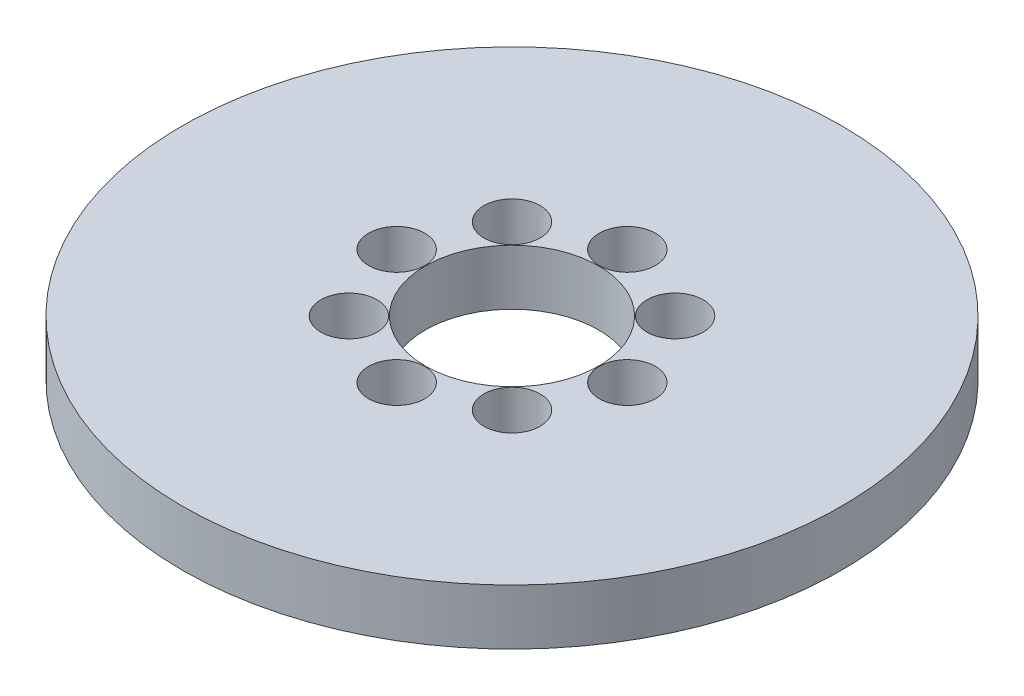
ISO-10303-21;
HEADER;
FILE_DESCRIPTION(('STEP AP214'),'2;1');
FILE_NAME('part.step','',(''),(''),'','','');
FILE_SCHEMA(('AUTOMOTIVE_DESIGN { 1 0 10303 214 1 1 1 1 }'));
ENDSEC;
DATA;
#1=APPLICATION_CONTEXT('core data for automotive mechanical design processes');
#2=APPLICATION_PROTOCOL_DEFINITION('international standard','automotive_design',2000,#1);
#3=PRODUCT_CONTEXT('',#1,'mechanical');
#4=PRODUCT('Part','Part','',(#3));
#5=PRODUCT_RELATED_PRODUCT_CATEGORY('part','',(#4));
#6=PRODUCT_DEFINITION_FORMATION('','',#4);
#7=PRODUCT_DEFINITION_CONTEXT('part definition',#1,'design');
#8=PRODUCT_DEFINITION('design','',#6,#7);
#9=PRODUCT_DEFINITION_SHAPE('','',#8);
#10=(LENGTH_UNIT() NAMED_UNIT(*) SI_UNIT(.MILLI.,.METRE.));
#11=(NAMED_UNIT(*) PLANE_ANGLE_UNIT() SI_UNIT($,.RADIAN.));
#12=(NAMED_UNIT(*) SI_UNIT($,.STERADIAN.) SOLID_ANGLE_UNIT());
#13=UNCERTAINTY_MEASURE_WITH_UNIT(LENGTH_MEASURE(1.E-05),#10,'distance_accuracy_value','');
#14=(GEOMETRIC_REPRESENTATION_CONTEXT(3) GLOBAL_UNCERTAINTY_ASSIGNED_CONTEXT((#13)) GLOBAL_UNIT_ASSIGNED_CONTEXT((#10,
#11,#12)) REPRESENTATION_CONTEXT('',''));
#15=CARTESIAN_POINT('',(0.,0.,0.));
#16=DIRECTION('',(0.,0.,1.));
#17=DIRECTION('',(1.,0.,0.));
#18=AXIS2_PLACEMENT_3D('',#15,#16,#17);
#19=CARTESIAN_POINT('',(0.,16.,0.));
#20=DIRECTION('',(0.,-1.,0.));
#21=DIRECTION('',(0.,0.,-1.));
#22=AXIS2_PLACEMENT_3D('',#19,#20,#21);
#23=CYLINDRICAL_SURFACE('',#22,95.);
#24=CARTESIAN_POINT('',(0.,16.,0.));
#25=DIRECTION('',(0.,1.,0.));
#26=DIRECTION('',(0.,0.,1.));
#27=AXIS2_PLACEMENT_3D('',#24,#25,#26);
#28=CIRCLE('',#27,95.);
#29=CARTESIAN_POINT('',(0.,16.,95.));
#30=VERTEX_POINT('',#29);
#31=EDGE_CURVE('E10',#30,#30,#28,.T.);
#32=ORIENTED_EDGE('',*,*,#31,.F.);
#33=EDGE_LOOP('',(#32));
#34=FACE_BOUND('',#33,.T.);
#35=CARTESIAN_POINT('',(0.,0.,0.));
#36=DIRECTION('',(0.,1.,0.));
#37=DIRECTION('',(0.,0.,1.));
#38=AXIS2_PLACEMENT_3D('',#35,#36,#37);
#39=CIRCLE('',#38,95.);
#40=CARTESIAN_POINT('',(0.,0.,95.));
#41=VERTEX_POINT('',#40);
#42=EDGE_CURVE('E37',#41,#41,#39,.T.);
#43=ORIENTED_EDGE('',*,*,#42,.T.);
#44=EDGE_LOOP('',(#43));
#45=FACE_BOUND('',#44,.T.);
#46=ADVANCED_FACE('F40',(#34,#45),#23,.T.);
#47=CARTESIAN_POINT('',(0.,16.,0.));
#48=DIRECTION('',(0.,1.,0.));
#49=DIRECTION('',(0.,0.,1.));
#50=AXIS2_PLACEMENT_3D('',#47,#48,#49);
#51=PLANE('',#50);
#52=CARTESIAN_POINT('',(1.16069656259766E-13,16.,33.2436708077105));
#53=DIRECTION('',(0.,1.,0.));
#54=DIRECTION('',(1.,0.,0.));
#55=AXIS2_PLACEMENT_3D('',#52,#53,#54);
#56=CIRCLE('',#55,8.09890588882665);
#57=CARTESIAN_POINT('',(8.09890588882676,16.,33.2436708077105));
#58=VERTEX_POINT('',#57);
#59=EDGE_CURVE('E88',#58,#58,#56,.T.);
#60=ORIENTED_EDGE('',*,*,#59,.F.);
#61=EDGE_LOOP('',(#60));
#62=FACE_BOUND('',#61,.T.);
#63=CARTESIAN_POINT('',(23.5068250596655,16.,23.5068250596653));
#64=DIRECTION('',(0.,1.,0.));
#65=DIRECTION('',(0.707106781186544,0.,-0.707106781186551));
#66=AXIS2_PLACEMENT_3D('',#63,#64,#65);
#67=CIRCLE('',#66,8.09890588882665);
#68=CARTESIAN_POINT('',(29.2336163338465,16.,17.7800337854842));
#69=VERTEX_POINT('',#68);
#70=EDGE_CURVE('E79',#69,#69,#67,.T.);
#71=ORIENTED_EDGE('',*,*,#70,.F.);
#72=EDGE_LOOP('',(#71));
#73=FACE_BOUND('',#72,.T.);
#74=CARTESIAN_POINT('',(33.2436708077105,16.,0.));
#75=DIRECTION('',(0.,1.,0.));
#76=DIRECTION('',(0.,0.,-1.));
#77=AXIS2_PLACEMENT_3D('',#74,#75,#76);
#78=CIRCLE('',#77,8.09890588882665);
#79=CARTESIAN_POINT('',(33.2436708077105,16.,-8.09890588882665));
#80=VERTEX_POINT('',#79);
#81=EDGE_CURVE('E74',#80,#80,#78,.T.);
#82=ORIENTED_EDGE('',*,*,#81,.F.);
#83=EDGE_LOOP('',(#82));
#84=FACE_BOUND('',#83,.T.);
#85=CARTESIAN_POINT('',(23.5068250596652,16.,-23.5068250596656));
#86=DIRECTION('',(0.,1.,0.));
#87=DIRECTION('',(-0.707106781186554,0.,-0.707106781186541));
#88=AXIS2_PLACEMENT_3D('',#85,#86,#87);
#89=CIRCLE('',#88,8.09890588882665);
#90=CARTESIAN_POINT('',(17.7800337854842,16.,-29.2336163338465));
#91=VERTEX_POINT('',#90);
#92=EDGE_CURVE('E70',#91,#91,#89,.T.);
#93=ORIENTED_EDGE('',*,*,#92,.F.);
#94=EDGE_LOOP('',(#93));
#95=FACE_BOUND('',#94,.T.);
#96=CARTESIAN_POINT('',(-3.48208968779297E-13,16.,-33.2436708077105));
#97=DIRECTION('',(0.,1.,0.));
#98=DIRECTION('',(-1.,0.,0.));
#99=AXIS2_PLACEMENT_3D('',#96,#97,#98);
#100=CIRCLE('',#99,8.09890588882665);
#101=CARTESIAN_POINT('',(-8.098905888827,16.,-33.2436708077105));
#102=VERTEX_POINT('',#101);
#103=EDGE_CURVE('E100',#102,#102,#100,.T.);
#104=ORIENTED_EDGE('',*,*,#103,.F.);
#105=EDGE_LOOP('',(#104));
#106=FACE_BOUND('',#105,.T.);
#107=CARTESIAN_POINT('',(-23.5068250596657,16.,-23.5068250596651));
#108=DIRECTION('',(0.,1.,0.));
#109=DIRECTION('',(-0.707106781186539,0.,0.707106781186556));
#110=AXIS2_PLACEMENT_3D('',#107,#108,#109);
#111=CIRCLE('',#110,8.09890588882665);
#112=CARTESIAN_POINT('',(-29.2336163338466,16.,-17.7800337854841));
#113=VERTEX_POINT('',#112);
#114=EDGE_CURVE('E93',#113,#113,#111,.T.);
#115=ORIENTED_EDGE('',*,*,#114,.F.);
#116=EDGE_LOOP('',(#115));
#117=FACE_BOUND('',#116,.T.);
#118=CARTESIAN_POINT('',(-23.5068250596654,16.,23.5068250596654));
#119=DIRECTION('',(0.,1.,0.));
#120=DIRECTION('',(0.707106781186549,0.,0.707106781186546));
#121=AXIS2_PLACEMENT_3D('',#118,#119,#120);
#122=CIRCLE('',#121,8.09890588882665);
#123=CARTESIAN_POINT('',(-17.7800337854844,16.,29.2336163338464));
#124=VERTEX_POINT('',#123);
#125=EDGE_CURVE('E61',#124,#124,#122,.T.);
#126=ORIENTED_EDGE('',*,*,#125,.F.);
#127=EDGE_LOOP('',(#126));
#128=FACE_BOUND('',#127,.T.);
#129=CARTESIAN_POINT('',(-33.2436708077105,16.,0.));
#130=DIRECTION('',(0.,1.,0.));
#131=DIRECTION('',(0.,0.,1.));
#132=AXIS2_PLACEMENT_3D('',#129,#130,#131);
#133=CIRCLE('',#132,8.09890588882665);
#134=CARTESIAN_POINT('',(-33.2436708077105,16.,8.09890588882665));
#135=VERTEX_POINT('',#134);
#136=EDGE_CURVE('E54',#135,#135,#133,.T.);
#137=ORIENTED_EDGE('',*,*,#136,.F.);
#138=EDGE_LOOP('',(#137));
#139=FACE_BOUND('',#138,.T.);
#140=CARTESIAN_POINT('',(0.,16.,0.));
#141=DIRECTION('',(0.,1.,0.));
#142=DIRECTION('',(0.,0.,1.));
#143=AXIS2_PLACEMENT_3D('',#140,#141,#142);
#144=CIRCLE('',#143,25.);
#145=CARTESIAN_POINT('',(0.,16.,25.));
#146=VERTEX_POINT('',#145);
#147=EDGE_CURVE('E50',#146,#146,#144,.T.);
#148=ORIENTED_EDGE('',*,*,#147,.F.);
#149=EDGE_LOOP('',(#148));
#150=FACE_BOUND('',#149,.T.);
#151=ORIENTED_EDGE('',*,*,#31,.T.);
#152=EDGE_LOOP('',(#151));
#153=FACE_BOUND('',#152,.T.);
#154=ADVANCED_FACE('F115',(#62,#73,#84,#95,#106,#117,#128,#139,#150,#153),#51,.T.);
#155=CARTESIAN_POINT('',(0.,0.,0.));
#156=DIRECTION('',(0.,1.,0.));
#157=DIRECTION('',(0.,0.,1.));
#158=AXIS2_PLACEMENT_3D('',#155,#156,#157);
#159=PLANE('',#158);
#160=CARTESIAN_POINT('',(0.,0.,0.));
#161=DIRECTION('',(0.,1.,0.));
#162=DIRECTION('',(0.,0.,1.));
#163=AXIS2_PLACEMENT_3D('',#160,#161,#162);
#164=CIRCLE('',#163,25.);
#165=CARTESIAN_POINT('',(0.,0.,25.));
#166=VERTEX_POINT('',#165);
#167=EDGE_CURVE('E47',#166,#166,#164,.T.);
#168=ORIENTED_EDGE('',*,*,#167,.T.);
#169=EDGE_LOOP('',(#168));
#170=FACE_BOUND('',#169,.T.);
#171=ORIENTED_EDGE('',*,*,#42,.F.);
#172=EDGE_LOOP('',(#171));
#173=FACE_BOUND('',#172,.T.);
#174=ADVANCED_FACE('F113',(#170,#173),#159,.F.);
#175=CARTESIAN_POINT('',(0.,16.,0.));
#176=DIRECTION('',(0.,-1.,0.));
#177=DIRECTION('',(0.,0.,-1.));
#178=AXIS2_PLACEMENT_3D('',#175,#176,#177);
#179=CYLINDRICAL_SURFACE('',#178,25.);
#180=ORIENTED_EDGE('',*,*,#147,.T.);
#181=EDGE_LOOP('',(#180));
#182=FACE_BOUND('',#181,.T.);
#183=ORIENTED_EDGE('',*,*,#167,.F.);
#184=EDGE_LOOP('',(#183));
#185=FACE_BOUND('',#184,.T.);
#186=ADVANCED_FACE('F127',(#182,#185),#179,.F.);
#187=CARTESIAN_POINT('',(-33.2436708077105,1.36895681976687,0.));
#188=DIRECTION('',(0.,1.,0.));
#189=DIRECTION('',(0.,0.,1.));
#190=AXIS2_PLACEMENT_3D('',#187,#188,#189);
#191=CYLINDRICAL_SURFACE('',#190,8.09890588882665);
#192=CARTESIAN_POINT('',(-33.2436708077105,1.36895681976687,0.));
#193=DIRECTION('',(0.,1.,0.));
#194=DIRECTION('',(0.,0.,1.));
#195=AXIS2_PLACEMENT_3D('',#192,#193,#194);
#196=CIRCLE('',#195,8.09890588882665);
#197=CARTESIAN_POINT('',(-33.2436708077105,1.36895681976687,8.09890588882665));
#198=VERTEX_POINT('',#197);
#199=EDGE_CURVE('E55',#198,#198,#196,.T.);
#200=ORIENTED_EDGE('',*,*,#199,.F.);
#201=EDGE_LOOP('',(#200));
#202=FACE_BOUND('',#201,.T.);
#203=ORIENTED_EDGE('',*,*,#136,.T.);
#204=EDGE_LOOP('',(#203));
#205=FACE_BOUND('',#204,.T.);
#206=ADVANCED_FACE('F129',(#202,#205),#191,.F.);
#207=CARTESIAN_POINT('',(-33.2436708077105,1.36895681976687,0.));
#208=DIRECTION('',(0.,1.,0.));
#209=DIRECTION('',(0.,0.,1.));
#210=AXIS2_PLACEMENT_3D('',#207,#208,#209);
#211=PLANE('',#210);
#212=ORIENTED_EDGE('',*,*,#199,.T.);
#213=EDGE_LOOP('',(#212));
#214=FACE_BOUND('',#213,.T.);
#215=ADVANCED_FACE('F157',(#214),#211,.T.);
#216=CARTESIAN_POINT('',(-23.5068250596654,1.36895681976687,23.5068250596654));
#217=DIRECTION('',(0.,1.,0.));
#218=DIRECTION('',(0.,0.,1.));
#219=AXIS2_PLACEMENT_3D('',#216,#217,#218);
#220=CYLINDRICAL_SURFACE('',#219,8.09890588882665);
#221=CARTESIAN_POINT('',(-23.5068250596654,1.36895681976687,23.5068250596654));
#222=DIRECTION('',(0.,1.,0.));
#223=DIRECTION('',(0.707106781186549,0.,0.707106781186546));
#224=AXIS2_PLACEMENT_3D('',#221,#222,#223);
#225=CIRCLE('',#224,8.09890588882665);
#226=CARTESIAN_POINT('',(-17.7800337854844,1.36895681976687,29.2336163338464));
#227=VERTEX_POINT('',#226);
#228=EDGE_CURVE('E59',#227,#227,#225,.T.);
#229=ORIENTED_EDGE('',*,*,#228,.F.);
#230=EDGE_LOOP('',(#229));
#231=FACE_BOUND('',#230,.T.);
#232=ORIENTED_EDGE('',*,*,#125,.T.);
#233=EDGE_LOOP('',(#232));
#234=FACE_BOUND('',#233,.T.);
#235=ADVANCED_FACE('F170',(#231,#234),#220,.F.);
#236=CARTESIAN_POINT('',(-23.5068250596654,1.36895681976687,23.5068250596654));
#237=DIRECTION('',(0.,1.,0.));
#238=DIRECTION('',(0.707106781186549,0.,0.707106781186546));
#239=AXIS2_PLACEMENT_3D('',#236,#237,#238);
#240=PLANE('',#239);
#241=ORIENTED_EDGE('',*,*,#228,.T.);
#242=EDGE_LOOP('',(#241));
#243=FACE_BOUND('',#242,.T.);
#244=ADVANCED_FACE('F182',(#243),#240,.T.);
#245=CARTESIAN_POINT('',(-23.5068250596657,1.36895681976687,-23.5068250596651));
#246=DIRECTION('',(0.,1.,0.));
#247=DIRECTION('',(0.,0.,1.));
#248=AXIS2_PLACEMENT_3D('',#245,#246,#247);
#249=CYLINDRICAL_SURFACE('',#248,8.09890588882665);
#250=CARTESIAN_POINT('',(-23.5068250596657,1.36895681976687,-23.5068250596651));
#251=DIRECTION('',(0.,1.,0.));
#252=DIRECTION('',(-0.707106781186539,0.,0.707106781186556));
#253=AXIS2_PLACEMENT_3D('',#250,#251,#252);
#254=CIRCLE('',#253,8.09890588882665);
#255=CARTESIAN_POINT('',(-29.2336163338466,1.36895681976687,-17.7800337854841));
#256=VERTEX_POINT('',#255);
#257=EDGE_CURVE('E94',#256,#256,#254,.T.);
#258=ORIENTED_EDGE('',*,*,#257,.F.);
#259=EDGE_LOOP('',(#258));
#260=FACE_BOUND('',#259,.T.);
#261=ORIENTED_EDGE('',*,*,#114,.T.);
#262=EDGE_LOOP('',(#261));
#263=FACE_BOUND('',#262,.T.);
#264=ADVANCED_FACE('F189',(#260,#263),#249,.F.);
#265=CARTESIAN_POINT('',(-23.5068250596657,1.36895681976687,-23.5068250596651));
#266=DIRECTION('',(0.,1.,0.));
#267=DIRECTION('',(-0.707106781186539,0.,0.707106781186556));
#268=AXIS2_PLACEMENT_3D('',#265,#266,#267);
#269=PLANE('',#268);
#270=ORIENTED_EDGE('',*,*,#257,.T.);
#271=EDGE_LOOP('',(#270));
#272=FACE_BOUND('',#271,.T.);
#273=ADVANCED_FACE('F107',(#272),#269,.T.);
#274=CARTESIAN_POINT('',(-3.48208968779297E-13,1.36895681976687,-33.2436708077105));
#275=DIRECTION('',(0.,1.,0.));
#276=DIRECTION('',(0.,0.,1.));
#277=AXIS2_PLACEMENT_3D('',#274,#275,#276);
#278=CYLINDRICAL_SURFACE('',#277,8.09890588882665);
#279=CARTESIAN_POINT('',(-3.48208968779297E-13,1.36895681976687,-33.2436708077105));
#280=DIRECTION('',(0.,1.,0.));
#281=DIRECTION('',(-1.,0.,0.));
#282=AXIS2_PLACEMENT_3D('',#279,#280,#281);
#283=CIRCLE('',#282,8.09890588882665);
#284=CARTESIAN_POINT('',(-8.098905888827,1.36895681976687,-33.2436708077105));
#285=VERTEX_POINT('',#284);
#286=EDGE_CURVE('E72',#285,#285,#283,.T.);
#287=ORIENTED_EDGE('',*,*,#286,.F.);
#288=EDGE_LOOP('',(#287));
#289=FACE_BOUND('',#288,.T.);
#290=ORIENTED_EDGE('',*,*,#103,.T.);
#291=EDGE_LOOP('',(#290));
#292=FACE_BOUND('',#291,.T.);
#293=ADVANCED_FACE('F104',(#289,#292),#278,.F.);
#294=CARTESIAN_POINT('',(-3.48208968779297E-13,1.36895681976687,-33.2436708077105));
#295=DIRECTION('',(0.,1.,0.));
#296=DIRECTION('',(-1.,0.,0.));
#297=AXIS2_PLACEMENT_3D('',#294,#295,#296);
#298=PLANE('',#297);
#299=ORIENTED_EDGE('',*,*,#286,.T.);
#300=EDGE_LOOP('',(#299));
#301=FACE_BOUND('',#300,.T.);
#302=ADVANCED_FACE('F103',(#301),#298,.T.);
#303=CARTESIAN_POINT('',(23.5068250596652,1.36895681976687,-23.5068250596656));
#304=DIRECTION('',(0.,1.,0.));
#305=DIRECTION('',(0.,0.,1.));
#306=AXIS2_PLACEMENT_3D('',#303,#304,#305);
#307=CYLINDRICAL_SURFACE('',#306,8.09890588882665);
#308=CARTESIAN_POINT('',(23.5068250596652,1.36895681976687,-23.5068250596656));
#309=DIRECTION('',(0.,1.,0.));
#310=DIRECTION('',(-0.707106781186554,0.,-0.707106781186541));
#311=AXIS2_PLACEMENT_3D('',#308,#309,#310);
#312=CIRCLE('',#311,8.09890588882665);
#313=CARTESIAN_POINT('',(17.7800337854842,1.36895681976687,-29.2336163338465));
#314=VERTEX_POINT('',#313);
#315=EDGE_CURVE('E69',#314,#314,#312,.T.);
#316=ORIENTED_EDGE('',*,*,#315,.F.);
#317=EDGE_LOOP('',(#316));
#318=FACE_BOUND('',#317,.T.);
#319=ORIENTED_EDGE('',*,*,#92,.T.);
#320=EDGE_LOOP('',(#319));
#321=FACE_BOUND('',#320,.T.);
#322=ADVANCED_FACE('F219',(#318,#321),#307,.F.);
#323=CARTESIAN_POINT('',(23.5068250596652,1.36895681976687,-23.5068250596656));
#324=DIRECTION('',(0.,1.,0.));
#325=DIRECTION('',(-0.707106781186554,0.,-0.707106781186541));
#326=AXIS2_PLACEMENT_3D('',#323,#324,#325);
#327=PLANE('',#326);
#328=ORIENTED_EDGE('',*,*,#315,.T.);
#329=EDGE_LOOP('',(#328));
#330=FACE_BOUND('',#329,.T.);
#331=ADVANCED_FACE('F227',(#330),#327,.T.);
#332=CARTESIAN_POINT('',(33.2436708077105,1.36895681976687,0.));
#333=DIRECTION('',(0.,1.,0.));
#334=DIRECTION('',(0.,0.,1.));
#335=AXIS2_PLACEMENT_3D('',#332,#333,#334);
#336=CYLINDRICAL_SURFACE('',#335,8.09890588882665);
#337=CARTESIAN_POINT('',(33.2436708077105,1.36895681976687,0.));
#338=DIRECTION('',(0.,1.,0.));
#339=DIRECTION('',(0.,0.,-1.));
#340=AXIS2_PLACEMENT_3D('',#337,#338,#339);
#341=CIRCLE('',#340,8.09890588882665);
#342=CARTESIAN_POINT('',(33.2436708077105,1.36895681976687,-8.09890588882665));
#343=VERTEX_POINT('',#342);
#344=EDGE_CURVE('E80',#343,#343,#341,.T.);
#345=ORIENTED_EDGE('',*,*,#344,.F.);
#346=EDGE_LOOP('',(#345));
#347=FACE_BOUND('',#346,.T.);
#348=ORIENTED_EDGE('',*,*,#81,.T.);
#349=EDGE_LOOP('',(#348));
#350=FACE_BOUND('',#349,.T.);
#351=ADVANCED_FACE('F240',(#347,#350),#336,.F.);
#352=CARTESIAN_POINT('',(33.2436708077105,1.36895681976687,0.));
#353=DIRECTION('',(0.,1.,0.));
#354=DIRECTION('',(0.,0.,-1.));
#355=AXIS2_PLACEMENT_3D('',#352,#353,#354);
#356=PLANE('',#355);
#357=ORIENTED_EDGE('',*,*,#344,.T.);
#358=EDGE_LOOP('',(#357));
#359=FACE_BOUND('',#358,.T.);
#360=ADVANCED_FACE('F246',(#359),#356,.T.);
#361=CARTESIAN_POINT('',(23.5068250596655,1.36895681976687,23.5068250596653));
#362=DIRECTION('',(0.,1.,0.));
#363=DIRECTION('',(0.,0.,1.));
#364=AXIS2_PLACEMENT_3D('',#361,#362,#363);
#365=CYLINDRICAL_SURFACE('',#364,8.09890588882665);
#366=CARTESIAN_POINT('',(23.5068250596655,1.36895681976687,23.5068250596653));
#367=DIRECTION('',(0.,1.,0.));
#368=DIRECTION('',(0.707106781186544,0.,-0.707106781186551));
#369=AXIS2_PLACEMENT_3D('',#366,#367,#368);
#370=CIRCLE('',#369,8.09890588882665);
#371=CARTESIAN_POINT('',(29.2336163338465,1.36895681976687,17.7800337854842));
#372=VERTEX_POINT('',#371);
#373=EDGE_CURVE('E82',#372,#372,#370,.T.);
#374=ORIENTED_EDGE('',*,*,#373,.F.);
#375=EDGE_LOOP('',(#374));
#376=FACE_BOUND('',#375,.T.);
#377=ORIENTED_EDGE('',*,*,#70,.T.);
#378=EDGE_LOOP('',(#377));
#379=FACE_BOUND('',#378,.T.);
#380=ADVANCED_FACE('F254',(#376,#379),#365,.F.);
#381=CARTESIAN_POINT('',(23.5068250596655,1.36895681976687,23.5068250596653));
#382=DIRECTION('',(0.,1.,0.));
#383=DIRECTION('',(0.707106781186544,0.,-0.707106781186551));
#384=AXIS2_PLACEMENT_3D('',#381,#382,#383);
#385=PLANE('',#384);
#386=ORIENTED_EDGE('',*,*,#373,.T.);
#387=EDGE_LOOP('',(#386));
#388=FACE_BOUND('',#387,.T.);
#389=ADVANCED_FACE('F262',(#388),#385,.T.);
#390=CARTESIAN_POINT('',(1.16069656259766E-13,1.36895681976687,33.2436708077105));
#391=DIRECTION('',(0.,1.,0.));
#392=DIRECTION('',(0.,0.,1.));
#393=AXIS2_PLACEMENT_3D('',#390,#391,#392);
#394=CYLINDRICAL_SURFACE('',#393,8.09890588882665);
#395=CARTESIAN_POINT('',(1.16069656259766E-13,1.36895681976687,33.2436708077105));
#396=DIRECTION('',(0.,1.,0.));
#397=DIRECTION('',(1.,0.,0.));
#398=AXIS2_PLACEMENT_3D('',#395,#396,#397);
#399=CIRCLE('',#398,8.09890588882665);
#400=CARTESIAN_POINT('',(8.09890588882676,1.36895681976687,33.2436708077105));
#401=VERTEX_POINT('',#400);
#402=EDGE_CURVE('E63',#401,#401,#399,.T.);
#403=ORIENTED_EDGE('',*,*,#402,.F.);
#404=EDGE_LOOP('',(#403));
#405=FACE_BOUND('',#404,.T.);
#406=ORIENTED_EDGE('',*,*,#59,.T.);
#407=EDGE_LOOP('',(#406));
#408=FACE_BOUND('',#407,.T.);
#409=ADVANCED_FACE('F272',(#405,#408),#394,.F.);
#410=CARTESIAN_POINT('',(1.16069656259766E-13,1.36895681976687,33.2436708077105));
#411=DIRECTION('',(0.,1.,0.));
#412=DIRECTION('',(1.,0.,0.));
#413=AXIS2_PLACEMENT_3D('',#410,#411,#412);
#414=PLANE('',#413);
#415=ORIENTED_EDGE('',*,*,#402,.T.);
#416=EDGE_LOOP('',(#415));
#417=FACE_BOUND('',#416,.T.);
#418=ADVANCED_FACE('F285',(#417),#414,.T.);
#419=CLOSED_SHELL('',(#46,#154,#174,#186,#206,#215,#235,#244,#264,#273,#293,#302,#322,#331,#351,
#360,#380,#389,#409,#418));
#420=MANIFOLD_SOLID_BREP('B2',#419);
#421=ADVANCED_BREP_SHAPE_REPRESENTATION('',(#18,#420),#14);
#422=SHAPE_DEFINITION_REPRESENTATION(#9,#421);
ENDSEC;
END-ISO-10303-21;
